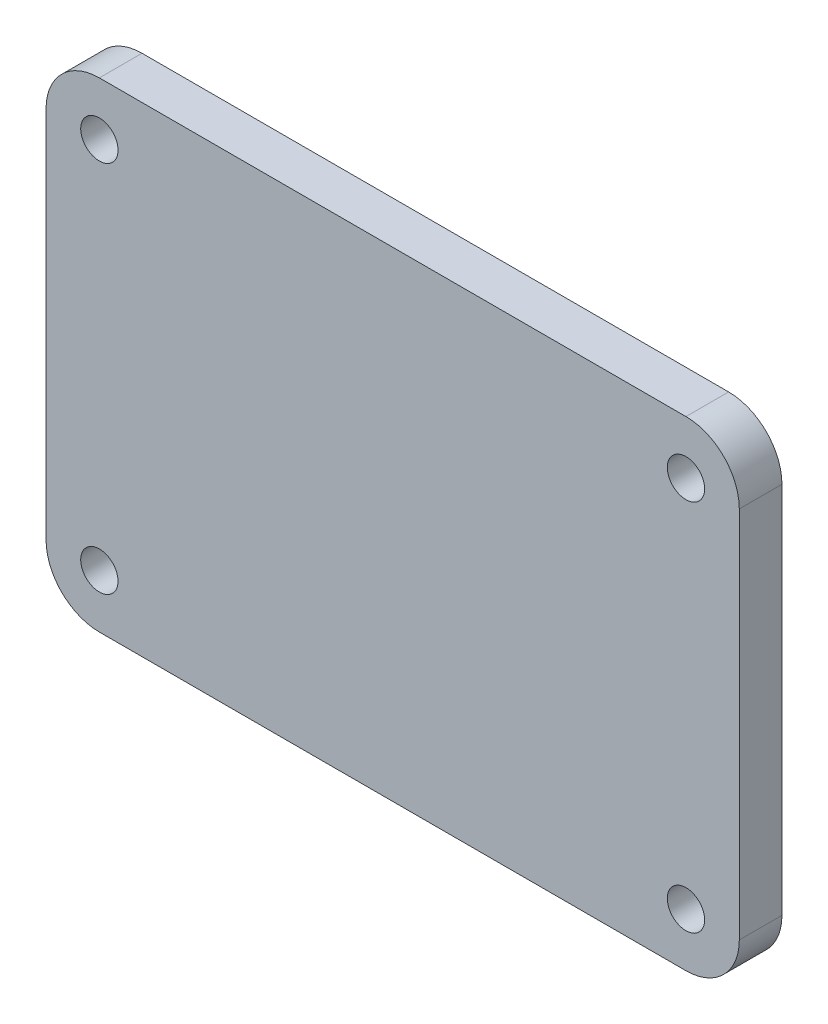
ISO-10303-21;
HEADER;
FILE_DESCRIPTION(('STEP AP214'),'2;1');
FILE_NAME('part.step','',(''),(''),'','','');
FILE_SCHEMA(('AUTOMOTIVE_DESIGN { 1 0 10303 214 1 1 1 1 }'));
ENDSEC;
DATA;
#1=APPLICATION_CONTEXT('core data for automotive mechanical design processes');
#2=APPLICATION_PROTOCOL_DEFINITION('international standard','automotive_design',2000,#1);
#3=PRODUCT_CONTEXT('',#1,'mechanical');
#4=PRODUCT('Part','Part','',(#3));
#5=PRODUCT_RELATED_PRODUCT_CATEGORY('part','',(#4));
#6=PRODUCT_DEFINITION_FORMATION('','',#4);
#7=PRODUCT_DEFINITION_CONTEXT('part definition',#1,'design');
#8=PRODUCT_DEFINITION('design','',#6,#7);
#9=PRODUCT_DEFINITION_SHAPE('','',#8);
#10=(LENGTH_UNIT() NAMED_UNIT(*) SI_UNIT(.MILLI.,.METRE.));
#11=(NAMED_UNIT(*) PLANE_ANGLE_UNIT() SI_UNIT($,.RADIAN.));
#12=(NAMED_UNIT(*) SI_UNIT($,.STERADIAN.) SOLID_ANGLE_UNIT());
#13=UNCERTAINTY_MEASURE_WITH_UNIT(LENGTH_MEASURE(1.E-05),#10,'distance_accuracy_value','');
#14=(GEOMETRIC_REPRESENTATION_CONTEXT(3) GLOBAL_UNCERTAINTY_ASSIGNED_CONTEXT((#13)) GLOBAL_UNIT_ASSIGNED_CONTEXT((#10,
#11,#12)) REPRESENTATION_CONTEXT('',''));
#15=CARTESIAN_POINT('',(0.,0.,0.));
#16=DIRECTION('',(0.,0.,1.));
#17=DIRECTION('',(1.,0.,0.));
#18=AXIS2_PLACEMENT_3D('',#15,#16,#17);
#19=CARTESIAN_POINT('',(32.4999999999991,-22.5,3.99999999999999));
#20=DIRECTION('',(-1.,0.,0.));
#21=DIRECTION('',(0.,0.,1.));
#22=AXIS2_PLACEMENT_3D('',#19,#20,#21);
#23=PLANE('',#22);
#24=DIRECTION('',(0.,1.,0.));
#25=VECTOR('',#24,1.);
#26=CARTESIAN_POINT('',(32.4999999999991,-22.5,3.99999999999999));
#27=LINE('',#26,#25);
#28=CARTESIAN_POINT('',(32.4999999999991,-17.5,3.99999999999993));
#29=VERTEX_POINT('',#28);
#30=CARTESIAN_POINT('',(32.5,17.5,4.00000000000002));
#31=VERTEX_POINT('',#30);
#32=EDGE_CURVE('E140',#29,#31,#27,.T.);
#33=ORIENTED_EDGE('',*,*,#32,.F.);
#34=DIRECTION('',(0.,0.,-1.));
#35=VECTOR('',#34,1.);
#36=CARTESIAN_POINT('',(32.4999999999991,-17.5,3.99999999999993));
#37=LINE('',#36,#35);
#38=CARTESIAN_POINT('',(32.5,-17.5,0.));
#39=VERTEX_POINT('',#38);
#40=EDGE_CURVE('E13',#29,#39,#37,.T.);
#41=ORIENTED_EDGE('',*,*,#40,.T.);
#42=DIRECTION('',(0.,1.,0.));
#43=VECTOR('',#42,1.);
#44=CARTESIAN_POINT('',(32.4999999999991,-22.5,0.));
#45=LINE('',#44,#43);
#46=CARTESIAN_POINT('',(32.5,17.5,0.));
#47=VERTEX_POINT('',#46);
#48=EDGE_CURVE('E171',#39,#47,#45,.T.);
#49=ORIENTED_EDGE('',*,*,#48,.T.);
#50=DIRECTION('',(0.,0.,-1.));
#51=VECTOR('',#50,1.);
#52=CARTESIAN_POINT('',(32.5,17.5,4.00000000000002));
#53=LINE('',#52,#51);
#54=EDGE_CURVE('E54',#47,#31,#53,.F.);
#55=ORIENTED_EDGE('',*,*,#54,.T.);
#56=EDGE_LOOP('',(#33,#41,#49,#55));
#57=FACE_BOUND('',#56,.T.);
#58=ADVANCED_FACE('F46',(#57),#23,.F.);
#59=CARTESIAN_POINT('',(-32.5000000000004,22.5,4.00000000000002));
#60=DIRECTION('',(0.,-1.,0.));
#61=DIRECTION('',(0.,0.,-1.));
#62=AXIS2_PLACEMENT_3D('',#59,#60,#61);
#63=PLANE('',#62);
#64=DIRECTION('',(-1.,0.,0.));
#65=VECTOR('',#64,1.);
#66=CARTESIAN_POINT('',(-32.5000000000004,22.5,0.));
#67=LINE('',#66,#65);
#68=CARTESIAN_POINT('',(27.4999999999999,22.5,0.));
#69=VERTEX_POINT('',#68);
#70=CARTESIAN_POINT('',(-27.5000000000005,22.5,0.));
#71=VERTEX_POINT('',#70);
#72=EDGE_CURVE('E145',#69,#71,#67,.T.);
#73=ORIENTED_EDGE('',*,*,#72,.T.);
#74=DIRECTION('',(0.,0.,-1.));
#75=VECTOR('',#74,1.);
#76=CARTESIAN_POINT('',(-27.5000000000005,22.5,3.99999999999999));
#77=LINE('',#76,#75);
#78=CARTESIAN_POINT('',(-27.5000000000005,22.5,3.99999999999999));
#79=VERTEX_POINT('',#78);
#80=EDGE_CURVE('E61',#71,#79,#77,.F.);
#81=ORIENTED_EDGE('',*,*,#80,.T.);
#82=DIRECTION('',(-1.,0.,0.));
#83=VECTOR('',#82,1.);
#84=CARTESIAN_POINT('',(-32.5000000000004,22.5,4.00000000000002));
#85=LINE('',#84,#83);
#86=CARTESIAN_POINT('',(27.5000000000001,22.5,3.99999999999999));
#87=VERTEX_POINT('',#86);
#88=EDGE_CURVE('E143',#87,#79,#85,.T.);
#89=ORIENTED_EDGE('',*,*,#88,.F.);
#90=DIRECTION('',(0.,0.,-1.));
#91=VECTOR('',#90,1.);
#92=CARTESIAN_POINT('',(27.5000000000001,22.5,3.99999999999999));
#93=LINE('',#92,#91);
#94=EDGE_CURVE('E163',#87,#69,#93,.T.);
#95=ORIENTED_EDGE('',*,*,#94,.T.);
#96=EDGE_LOOP('',(#73,#81,#89,#95));
#97=FACE_BOUND('',#96,.T.);
#98=ADVANCED_FACE('F178',(#97),#63,.F.);
#99=CARTESIAN_POINT('',(-32.5000000000009,-22.5,4.00000000000002));
#100=DIRECTION('',(1.,0.,0.));
#101=DIRECTION('',(0.,0.,-1.));
#102=AXIS2_PLACEMENT_3D('',#99,#100,#101);
#103=PLANE('',#102);
#104=DIRECTION('',(0.,-1.,0.));
#105=VECTOR('',#104,1.);
#106=CARTESIAN_POINT('',(-32.5000000000009,-22.5,0.));
#107=LINE('',#106,#105);
#108=CARTESIAN_POINT('',(-32.5000000000004,17.5,0.));
#109=VERTEX_POINT('',#108);
#110=CARTESIAN_POINT('',(-32.5000000000009,-17.5,0.));
#111=VERTEX_POINT('',#110);
#112=EDGE_CURVE('E141',#109,#111,#107,.T.);
#113=ORIENTED_EDGE('',*,*,#112,.T.);
#114=DIRECTION('',(0.,0.,-1.));
#115=VECTOR('',#114,1.);
#116=CARTESIAN_POINT('',(-32.5000000000009,-17.5,3.99999999999999));
#117=LINE('',#116,#115);
#118=CARTESIAN_POINT('',(-32.5000000000009,-17.5,3.99999999999999));
#119=VERTEX_POINT('',#118);
#120=EDGE_CURVE('E118',#111,#119,#117,.F.);
#121=ORIENTED_EDGE('',*,*,#120,.T.);
#122=DIRECTION('',(0.,-1.,0.));
#123=VECTOR('',#122,1.);
#124=CARTESIAN_POINT('',(-32.5000000000009,-22.5,4.00000000000002));
#125=LINE('',#124,#123);
#126=CARTESIAN_POINT('',(-32.5000000000009,17.5,4.00000000000007));
#127=VERTEX_POINT('',#126);
#128=EDGE_CURVE('E183',#127,#119,#125,.T.);
#129=ORIENTED_EDGE('',*,*,#128,.F.);
#130=DIRECTION('',(0.,0.,-1.));
#131=VECTOR('',#130,1.);
#132=CARTESIAN_POINT('',(-32.5000000000009,17.5,4.00000000000007));
#133=LINE('',#132,#131);
#134=EDGE_CURVE('E123',#127,#109,#133,.T.);
#135=ORIENTED_EDGE('',*,*,#134,.T.);
#136=EDGE_LOOP('',(#113,#121,#129,#135));
#137=FACE_BOUND('',#136,.T.);
#138=ADVANCED_FACE('F241',(#137),#103,.F.);
#139=CARTESIAN_POINT('',(-32.5000000000009,-22.5,4.00000000000002));
#140=DIRECTION('',(0.,1.,0.));
#141=DIRECTION('',(0.,0.,1.));
#142=AXIS2_PLACEMENT_3D('',#139,#140,#141);
#143=PLANE('',#142);
#144=DIRECTION('',(1.,0.,0.));
#145=VECTOR('',#144,1.);
#146=CARTESIAN_POINT('',(-32.5000000000009,-22.5,4.00000000000002));
#147=LINE('',#146,#145);
#148=CARTESIAN_POINT('',(-27.5000000000009,-22.5,4.00000000000002));
#149=VERTEX_POINT('',#148);
#150=CARTESIAN_POINT('',(27.4999999999992,-22.5,4.00000000000002));
#151=VERTEX_POINT('',#150);
#152=EDGE_CURVE('E133',#149,#151,#147,.T.);
#153=ORIENTED_EDGE('',*,*,#152,.F.);
#154=DIRECTION('',(0.,0.,-1.));
#155=VECTOR('',#154,1.);
#156=CARTESIAN_POINT('',(-27.5000000000009,-22.5,4.00000000000002));
#157=LINE('',#156,#155);
#158=CARTESIAN_POINT('',(-27.5000000000009,-22.5,0.));
#159=VERTEX_POINT('',#158);
#160=EDGE_CURVE('E117',#149,#159,#157,.T.);
#161=ORIENTED_EDGE('',*,*,#160,.T.);
#162=DIRECTION('',(1.,0.,0.));
#163=VECTOR('',#162,1.);
#164=CARTESIAN_POINT('',(-32.5000000000009,-22.5,0.));
#165=LINE('',#164,#163);
#166=CARTESIAN_POINT('',(27.4999999999992,-22.5,0.));
#167=VERTEX_POINT('',#166);
#168=EDGE_CURVE('E130',#159,#167,#165,.T.);
#169=ORIENTED_EDGE('',*,*,#168,.T.);
#170=DIRECTION('',(0.,0.,-1.));
#171=VECTOR('',#170,1.);
#172=CARTESIAN_POINT('',(27.4999999999992,-22.5,4.00000000000002));
#173=LINE('',#172,#171);
#174=EDGE_CURVE('E135',#167,#151,#173,.F.);
#175=ORIENTED_EDGE('',*,*,#174,.T.);
#176=EDGE_LOOP('',(#153,#161,#169,#175));
#177=FACE_BOUND('',#176,.T.);
#178=ADVANCED_FACE('F129',(#177),#143,.F.);
#179=CARTESIAN_POINT('',(0.,0.,3.99999999999999));
#180=DIRECTION('',(0.,0.,-1.));
#181=DIRECTION('',(-1.,0.,0.));
#182=AXIS2_PLACEMENT_3D('',#179,#180,#181);
#183=PLANE('',#182);
#184=CARTESIAN_POINT('',(-27.5000000000009,17.5,4.00000000000002));
#185=DIRECTION('',(0.,0.,1.));
#186=DIRECTION('',(1.,0.,0.));
#187=AXIS2_PLACEMENT_3D('',#184,#185,#186);
#188=CIRCLE('',#187,1.74999999999999);
#189=CARTESIAN_POINT('',(-25.7500000000009,17.5,4.00000000000002));
#190=VERTEX_POINT('',#189);
#191=EDGE_CURVE('E206',#190,#190,#188,.T.);
#192=ORIENTED_EDGE('',*,*,#191,.F.);
#193=EDGE_LOOP('',(#192));
#194=FACE_BOUND('',#193,.T.);
#195=CARTESIAN_POINT('',(-27.5000000000009,-17.5,3.99999999999999));
#196=DIRECTION('',(0.,0.,1.));
#197=DIRECTION('',(1.,0.,0.));
#198=AXIS2_PLACEMENT_3D('',#195,#196,#197);
#199=CIRCLE('',#198,1.74999999999999);
#200=CARTESIAN_POINT('',(-25.7500000000009,-17.5,3.99999999999999));
#201=VERTEX_POINT('',#200);
#202=EDGE_CURVE('E200',#201,#201,#199,.T.);
#203=ORIENTED_EDGE('',*,*,#202,.F.);
#204=EDGE_LOOP('',(#203));
#205=FACE_BOUND('',#204,.T.);
#206=CARTESIAN_POINT('',(27.5000000000001,17.5,4.00000000000002));
#207=DIRECTION('',(0.,0.,1.));
#208=DIRECTION('',(1.,0.,0.));
#209=AXIS2_PLACEMENT_3D('',#206,#207,#208);
#210=CIRCLE('',#209,1.74999999999999);
#211=CARTESIAN_POINT('',(29.2500000000001,17.5,4.00000000000002));
#212=VERTEX_POINT('',#211);
#213=EDGE_CURVE('E194',#212,#212,#210,.T.);
#214=ORIENTED_EDGE('',*,*,#213,.F.);
#215=EDGE_LOOP('',(#214));
#216=FACE_BOUND('',#215,.T.);
#217=CARTESIAN_POINT('',(27.4999999999992,-17.5,3.99999999999999));
#218=DIRECTION('',(0.,0.,1.));
#219=DIRECTION('',(1.,0.,0.));
#220=AXIS2_PLACEMENT_3D('',#217,#218,#219);
#221=CIRCLE('',#220,1.74999999999999);
#222=CARTESIAN_POINT('',(29.2499999999992,-17.5,3.99999999999999));
#223=VERTEX_POINT('',#222);
#224=EDGE_CURVE('E188',#223,#223,#221,.T.);
#225=ORIENTED_EDGE('',*,*,#224,.F.);
#226=EDGE_LOOP('',(#225));
#227=FACE_BOUND('',#226,.T.);
#228=ORIENTED_EDGE('',*,*,#128,.T.);
#229=CARTESIAN_POINT('',(-27.5000000000009,-17.5,3.99999999999999));
#230=DIRECTION('',(0.,0.,-1.));
#231=DIRECTION('',(-1.,0.,0.));
#232=AXIS2_PLACEMENT_3D('',#229,#230,#231);
#233=CIRCLE('',#232,5.);
#234=EDGE_CURVE('E161',#119,#149,#233,.F.);
#235=ORIENTED_EDGE('',*,*,#234,.T.);
#236=ORIENTED_EDGE('',*,*,#152,.T.);
#237=CARTESIAN_POINT('',(27.4999999999992,-17.5,3.99999999999999));
#238=DIRECTION('',(0.,0.,-1.));
#239=DIRECTION('',(-1.,0.,0.));
#240=AXIS2_PLACEMENT_3D('',#237,#238,#239);
#241=CIRCLE('',#240,5.);
#242=EDGE_CURVE('E157',#151,#29,#241,.F.);
#243=ORIENTED_EDGE('',*,*,#242,.T.);
#244=ORIENTED_EDGE('',*,*,#32,.T.);
#245=CARTESIAN_POINT('',(27.5000000000001,17.5,4.00000000000002));
#246=DIRECTION('',(0.,0.,-1.));
#247=DIRECTION('',(-1.,0.,0.));
#248=AXIS2_PLACEMENT_3D('',#245,#246,#247);
#249=CIRCLE('',#248,5.);
#250=EDGE_CURVE('E68',#31,#87,#249,.F.);
#251=ORIENTED_EDGE('',*,*,#250,.T.);
#252=ORIENTED_EDGE('',*,*,#88,.T.);
#253=CARTESIAN_POINT('',(-27.5000000000009,17.5,4.00000000000002));
#254=DIRECTION('',(0.,0.,-1.));
#255=DIRECTION('',(-1.,0.,0.));
#256=AXIS2_PLACEMENT_3D('',#253,#254,#255);
#257=CIRCLE('',#256,5.);
#258=EDGE_CURVE('E159',#79,#127,#257,.F.);
#259=ORIENTED_EDGE('',*,*,#258,.T.);
#260=EDGE_LOOP('',(#228,#235,#236,#243,#244,#251,#252,#259));
#261=FACE_BOUND('',#260,.T.);
#262=ADVANCED_FACE('F174',(#194,#205,#216,#227,#261),#183,.F.);
#263=CARTESIAN_POINT('',(0.,0.,0.));
#264=DIRECTION('',(0.,0.,-1.));
#265=DIRECTION('',(-1.,0.,0.));
#266=AXIS2_PLACEMENT_3D('',#263,#264,#265);
#267=PLANE('',#266);
#268=CARTESIAN_POINT('',(-27.5000000000004,17.5,0.));
#269=DIRECTION('',(0.,0.,1.));
#270=DIRECTION('',(1.,0.,0.));
#271=AXIS2_PLACEMENT_3D('',#268,#269,#270);
#272=CIRCLE('',#271,1.75);
#273=CARTESIAN_POINT('',(-25.7500000000004,17.5,0.));
#274=VERTEX_POINT('',#273);
#275=EDGE_CURVE('E203',#274,#274,#272,.T.);
#276=ORIENTED_EDGE('',*,*,#275,.T.);
#277=EDGE_LOOP('',(#276));
#278=FACE_BOUND('',#277,.T.);
#279=CARTESIAN_POINT('',(-27.5000000000009,-17.5,0.));
#280=DIRECTION('',(0.,0.,1.));
#281=DIRECTION('',(1.,0.,0.));
#282=AXIS2_PLACEMENT_3D('',#279,#280,#281);
#283=CIRCLE('',#282,1.75);
#284=CARTESIAN_POINT('',(-25.7500000000009,-17.5,0.));
#285=VERTEX_POINT('',#284);
#286=EDGE_CURVE('E197',#285,#285,#283,.T.);
#287=ORIENTED_EDGE('',*,*,#286,.T.);
#288=EDGE_LOOP('',(#287));
#289=FACE_BOUND('',#288,.T.);
#290=CARTESIAN_POINT('',(27.5000000000001,17.5,0.));
#291=DIRECTION('',(0.,0.,1.));
#292=DIRECTION('',(1.,0.,0.));
#293=AXIS2_PLACEMENT_3D('',#290,#291,#292);
#294=CIRCLE('',#293,1.75);
#295=CARTESIAN_POINT('',(29.2500000000001,17.5,0.));
#296=VERTEX_POINT('',#295);
#297=EDGE_CURVE('E191',#296,#296,#294,.T.);
#298=ORIENTED_EDGE('',*,*,#297,.T.);
#299=EDGE_LOOP('',(#298));
#300=FACE_BOUND('',#299,.T.);
#301=CARTESIAN_POINT('',(27.5000000000001,-17.5,0.));
#302=DIRECTION('',(0.,0.,1.));
#303=DIRECTION('',(1.,0.,0.));
#304=AXIS2_PLACEMENT_3D('',#301,#302,#303);
#305=CIRCLE('',#304,1.75);
#306=CARTESIAN_POINT('',(29.2500000000001,-17.5,0.));
#307=VERTEX_POINT('',#306);
#308=EDGE_CURVE('E179',#307,#307,#305,.T.);
#309=ORIENTED_EDGE('',*,*,#308,.T.);
#310=EDGE_LOOP('',(#309));
#311=FACE_BOUND('',#310,.T.);
#312=ORIENTED_EDGE('',*,*,#168,.F.);
#313=CARTESIAN_POINT('',(-27.5000000000009,-17.5,0.));
#314=DIRECTION('',(0.,0.,-1.));
#315=DIRECTION('',(-1.,0.,0.));
#316=AXIS2_PLACEMENT_3D('',#313,#314,#315);
#317=CIRCLE('',#316,5.);
#318=EDGE_CURVE('E113',#159,#111,#317,.T.);
#319=ORIENTED_EDGE('',*,*,#318,.T.);
#320=ORIENTED_EDGE('',*,*,#112,.F.);
#321=CARTESIAN_POINT('',(-27.5000000000004,17.5,0.));
#322=DIRECTION('',(0.,0.,-1.));
#323=DIRECTION('',(-1.,0.,0.));
#324=AXIS2_PLACEMENT_3D('',#321,#322,#323);
#325=CIRCLE('',#324,5.);
#326=EDGE_CURVE('E124',#109,#71,#325,.T.);
#327=ORIENTED_EDGE('',*,*,#326,.T.);
#328=ORIENTED_EDGE('',*,*,#72,.F.);
#329=CARTESIAN_POINT('',(27.5000000000001,17.5,0.));
#330=DIRECTION('',(0.,0.,-1.));
#331=DIRECTION('',(-1.,0.,0.));
#332=AXIS2_PLACEMENT_3D('',#329,#330,#331);
#333=CIRCLE('',#332,5.);
#334=EDGE_CURVE('E134',#69,#47,#333,.T.);
#335=ORIENTED_EDGE('',*,*,#334,.T.);
#336=ORIENTED_EDGE('',*,*,#48,.F.);
#337=CARTESIAN_POINT('',(27.5000000000001,-17.5,0.));
#338=DIRECTION('',(0.,0.,-1.));
#339=DIRECTION('',(-1.,0.,0.));
#340=AXIS2_PLACEMENT_3D('',#337,#338,#339);
#341=CIRCLE('',#340,5.);
#342=EDGE_CURVE('E139',#39,#167,#341,.T.);
#343=ORIENTED_EDGE('',*,*,#342,.T.);
#344=EDGE_LOOP('',(#312,#319,#320,#327,#328,#335,#336,#343));
#345=FACE_BOUND('',#344,.T.);
#346=ADVANCED_FACE('F137',(#278,#289,#300,#311,#345),#267,.T.);
#347=CARTESIAN_POINT('',(27.4999999999992,-17.5,3.99999999999999));
#348=DIRECTION('',(0.,0.,1.));
#349=DIRECTION('',(1.,0.,0.));
#350=AXIS2_PLACEMENT_3D('',#347,#348,#349);
#351=CYLINDRICAL_SURFACE('',#350,1.74999999999999);
#352=ORIENTED_EDGE('',*,*,#308,.F.);
#353=EDGE_LOOP('',(#352));
#354=FACE_BOUND('',#353,.T.);
#355=ORIENTED_EDGE('',*,*,#224,.T.);
#356=EDGE_LOOP('',(#355));
#357=FACE_BOUND('',#356,.T.);
#358=ADVANCED_FACE('F221',(#354,#357),#351,.F.);
#359=CARTESIAN_POINT('',(27.5000000000001,17.5,4.00000000000002));
#360=DIRECTION('',(0.,0.,1.));
#361=DIRECTION('',(1.,0.,0.));
#362=AXIS2_PLACEMENT_3D('',#359,#360,#361);
#363=CYLINDRICAL_SURFACE('',#362,1.74999999999999);
#364=ORIENTED_EDGE('',*,*,#297,.F.);
#365=EDGE_LOOP('',(#364));
#366=FACE_BOUND('',#365,.T.);
#367=ORIENTED_EDGE('',*,*,#213,.T.);
#368=EDGE_LOOP('',(#367));
#369=FACE_BOUND('',#368,.T.);
#370=ADVANCED_FACE('F223',(#366,#369),#363,.F.);
#371=CARTESIAN_POINT('',(-27.5000000000009,-17.5,3.99999999999999));
#372=DIRECTION('',(0.,0.,1.));
#373=DIRECTION('',(1.,0.,0.));
#374=AXIS2_PLACEMENT_3D('',#371,#372,#373);
#375=CYLINDRICAL_SURFACE('',#374,1.74999999999999);
#376=ORIENTED_EDGE('',*,*,#286,.F.);
#377=EDGE_LOOP('',(#376));
#378=FACE_BOUND('',#377,.T.);
#379=ORIENTED_EDGE('',*,*,#202,.T.);
#380=EDGE_LOOP('',(#379));
#381=FACE_BOUND('',#380,.T.);
#382=ADVANCED_FACE('F230',(#378,#381),#375,.F.);
#383=CARTESIAN_POINT('',(-27.5000000000009,17.5,4.00000000000002));
#384=DIRECTION('',(0.,0.,1.));
#385=DIRECTION('',(1.,0.,0.));
#386=AXIS2_PLACEMENT_3D('',#383,#384,#385);
#387=CYLINDRICAL_SURFACE('',#386,1.74999999999999);
#388=ORIENTED_EDGE('',*,*,#275,.F.);
#389=EDGE_LOOP('',(#388));
#390=FACE_BOUND('',#389,.T.);
#391=ORIENTED_EDGE('',*,*,#191,.T.);
#392=EDGE_LOOP('',(#391));
#393=FACE_BOUND('',#392,.T.);
#394=ADVANCED_FACE('F210',(#390,#393),#387,.F.);
#395=CARTESIAN_POINT('',(-27.5000000000009,-17.5,3.99999999999999));
#396=DIRECTION('',(0.,0.,-1.));
#397=DIRECTION('',(-1.,0.,0.));
#398=AXIS2_PLACEMENT_3D('',#395,#396,#397);
#399=CYLINDRICAL_SURFACE('',#398,5.);
#400=ORIENTED_EDGE('',*,*,#234,.F.);
#401=ORIENTED_EDGE('',*,*,#120,.F.);
#402=ORIENTED_EDGE('',*,*,#318,.F.);
#403=ORIENTED_EDGE('',*,*,#160,.F.);
#404=EDGE_LOOP('',(#400,#401,#402,#403));
#405=FACE_BOUND('',#404,.T.);
#406=ADVANCED_FACE('F116',(#405),#399,.T.);
#407=CARTESIAN_POINT('',(-27.5000000000009,17.5,4.00000000000002));
#408=DIRECTION('',(0.,0.,-1.));
#409=DIRECTION('',(-1.,0.,0.));
#410=AXIS2_PLACEMENT_3D('',#407,#408,#409);
#411=CYLINDRICAL_SURFACE('',#410,5.);
#412=ORIENTED_EDGE('',*,*,#258,.F.);
#413=ORIENTED_EDGE('',*,*,#80,.F.);
#414=ORIENTED_EDGE('',*,*,#326,.F.);
#415=ORIENTED_EDGE('',*,*,#134,.F.);
#416=EDGE_LOOP('',(#412,#413,#414,#415));
#417=FACE_BOUND('',#416,.T.);
#418=ADVANCED_FACE('F247',(#417),#411,.T.);
#419=CARTESIAN_POINT('',(27.4999999999992,-17.5,3.99999999999999));
#420=DIRECTION('',(0.,0.,-1.));
#421=DIRECTION('',(-1.,0.,0.));
#422=AXIS2_PLACEMENT_3D('',#419,#420,#421);
#423=CYLINDRICAL_SURFACE('',#422,5.);
#424=ORIENTED_EDGE('',*,*,#242,.F.);
#425=ORIENTED_EDGE('',*,*,#174,.F.);
#426=ORIENTED_EDGE('',*,*,#342,.F.);
#427=ORIENTED_EDGE('',*,*,#40,.F.);
#428=EDGE_LOOP('',(#424,#425,#426,#427));
#429=FACE_BOUND('',#428,.T.);
#430=ADVANCED_FACE('F249',(#429),#423,.T.);
#431=CARTESIAN_POINT('',(27.5000000000001,17.5,4.00000000000002));
#432=DIRECTION('',(0.,0.,-1.));
#433=DIRECTION('',(-1.,0.,0.));
#434=AXIS2_PLACEMENT_3D('',#431,#432,#433);
#435=CYLINDRICAL_SURFACE('',#434,5.);
#436=ORIENTED_EDGE('',*,*,#250,.F.);
#437=ORIENTED_EDGE('',*,*,#54,.F.);
#438=ORIENTED_EDGE('',*,*,#334,.F.);
#439=ORIENTED_EDGE('',*,*,#94,.F.);
#440=EDGE_LOOP('',(#436,#437,#438,#439));
#441=FACE_BOUND('',#440,.T.);
#442=ADVANCED_FACE('F48',(#441),#435,.T.);
#443=CLOSED_SHELL('',(#58,#98,#138,#178,#262,#346,#358,#370,#382,#394,#406,#418,#430,#442));
#444=MANIFOLD_SOLID_BREP('B2',#443);
#445=ADVANCED_BREP_SHAPE_REPRESENTATION('',(#18,#444),#14);
#446=SHAPE_DEFINITION_REPRESENTATION(#9,#445);
ENDSEC;
END-ISO-10303-21;
